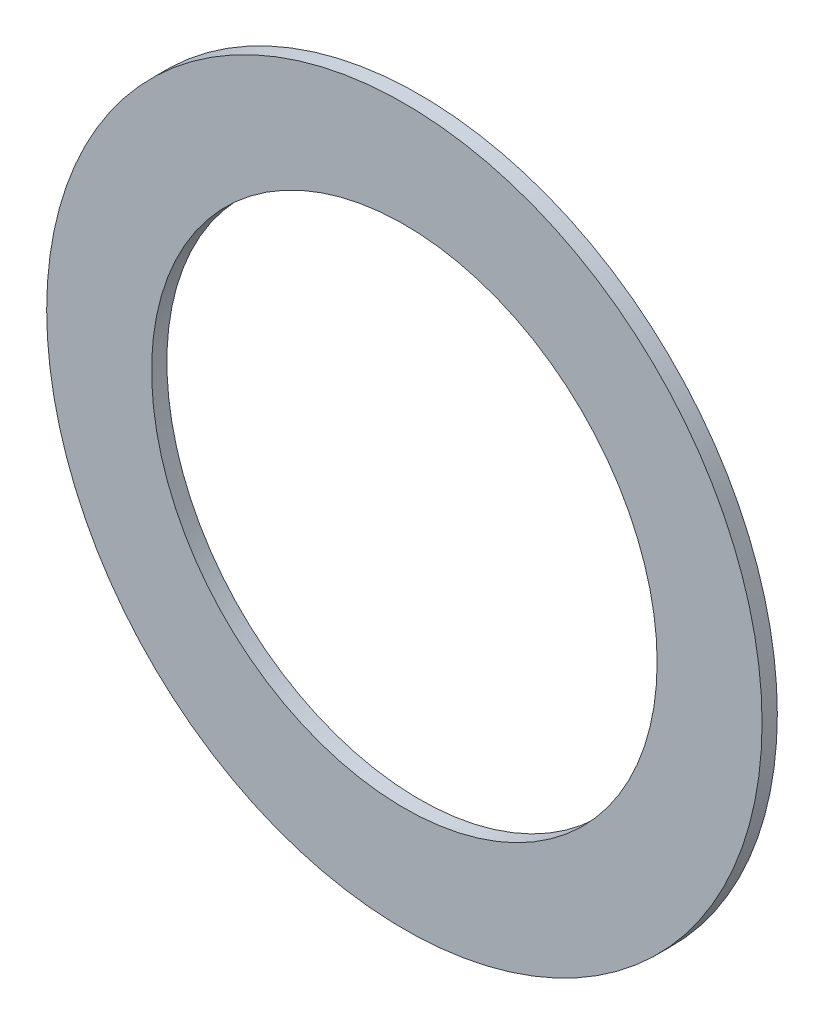
ISO-10303-21;
HEADER;
FILE_DESCRIPTION(('STEP AP214'),'2;1');
FILE_NAME('part.step','',(''),(''),'','','');
FILE_SCHEMA(('AUTOMOTIVE_DESIGN { 1 0 10303 214 1 1 1 1 }'));
ENDSEC;
DATA;
#1=APPLICATION_CONTEXT('core data for automotive mechanical design processes');
#2=APPLICATION_PROTOCOL_DEFINITION('international standard','automotive_design',2000,#1);
#3=PRODUCT_CONTEXT('',#1,'mechanical');
#4=PRODUCT('Part','Part','',(#3));
#5=PRODUCT_RELATED_PRODUCT_CATEGORY('part','',(#4));
#6=PRODUCT_DEFINITION_FORMATION('','',#4);
#7=PRODUCT_DEFINITION_CONTEXT('part definition',#1,'design');
#8=PRODUCT_DEFINITION('design','',#6,#7);
#9=PRODUCT_DEFINITION_SHAPE('','',#8);
#10=(LENGTH_UNIT() NAMED_UNIT(*) SI_UNIT(.MILLI.,.METRE.));
#11=(NAMED_UNIT(*) PLANE_ANGLE_UNIT() SI_UNIT($,.RADIAN.));
#12=(NAMED_UNIT(*) SI_UNIT($,.STERADIAN.) SOLID_ANGLE_UNIT());
#13=UNCERTAINTY_MEASURE_WITH_UNIT(LENGTH_MEASURE(1.E-05),#10,'distance_accuracy_value','');
#14=(GEOMETRIC_REPRESENTATION_CONTEXT(3) GLOBAL_UNCERTAINTY_ASSIGNED_CONTEXT((#13)) GLOBAL_UNIT_ASSIGNED_CONTEXT((#10,
#11,#12)) REPRESENTATION_CONTEXT('',''));
#15=CARTESIAN_POINT('',(0.,0.,0.));
#16=DIRECTION('',(0.,0.,1.));
#17=DIRECTION('',(1.,0.,0.));
#18=AXIS2_PLACEMENT_3D('',#15,#16,#17);
#19=CARTESIAN_POINT('',(0.,0.,0.));
#20=DIRECTION('',(0.,0.,-1.));
#21=DIRECTION('',(-1.,0.,0.));
#22=AXIS2_PLACEMENT_3D('',#19,#20,#21);
#23=PLANE('',#22);
#24=CARTESIAN_POINT('',(0.,0.,0.));
#25=DIRECTION('',(0.,0.,1.));
#26=DIRECTION('',(1.,0.,0.));
#27=AXIS2_PLACEMENT_3D('',#24,#25,#26);
#28=CIRCLE('',#27,6.731);
#29=CARTESIAN_POINT('',(6.731,0.,0.));
#30=VERTEX_POINT('',#29);
#31=EDGE_CURVE('E27',#30,#30,#28,.T.);
#32=ORIENTED_EDGE('',*,*,#31,.T.);
#33=EDGE_LOOP('',(#32));
#34=FACE_BOUND('',#33,.T.);
#35=CARTESIAN_POINT('',(0.,0.,0.));
#36=DIRECTION('',(0.,0.,1.));
#37=DIRECTION('',(1.,0.,0.));
#38=AXIS2_PLACEMENT_3D('',#35,#36,#37);
#39=CIRCLE('',#38,9.525);
#40=CARTESIAN_POINT('',(9.525,0.,0.));
#41=VERTEX_POINT('',#40);
#42=EDGE_CURVE('E18',#41,#41,#39,.T.);
#43=ORIENTED_EDGE('',*,*,#42,.F.);
#44=EDGE_LOOP('',(#43));
#45=FACE_BOUND('',#44,.T.);
#46=ADVANCED_FACE('F15',(#34,#45),#23,.T.);
#47=CARTESIAN_POINT('',(0.,0.,0.));
#48=DIRECTION('',(0.,0.,1.));
#49=DIRECTION('',(1.,0.,0.));
#50=AXIS2_PLACEMENT_3D('',#47,#48,#49);
#51=CYLINDRICAL_SURFACE('',#50,9.525);
#52=ORIENTED_EDGE('',*,*,#42,.T.);
#53=EDGE_LOOP('',(#52));
#54=FACE_BOUND('',#53,.T.);
#55=CARTESIAN_POINT('',(0.,0.,0.4064));
#56=DIRECTION('',(0.,0.,1.));
#57=DIRECTION('',(1.,0.,0.));
#58=AXIS2_PLACEMENT_3D('',#55,#56,#57);
#59=CIRCLE('',#58,9.525);
#60=CARTESIAN_POINT('',(9.525,0.,0.4064));
#61=VERTEX_POINT('',#60);
#62=EDGE_CURVE('E22',#61,#61,#59,.F.);
#63=ORIENTED_EDGE('',*,*,#62,.T.);
#64=EDGE_LOOP('',(#63));
#65=FACE_BOUND('',#64,.T.);
#66=ADVANCED_FACE('F35',(#54,#65),#51,.T.);
#67=CARTESIAN_POINT('',(0.,0.,0.));
#68=DIRECTION('',(0.,0.,1.));
#69=DIRECTION('',(1.,0.,0.));
#70=AXIS2_PLACEMENT_3D('',#67,#68,#69);
#71=CYLINDRICAL_SURFACE('',#70,6.731);
#72=ORIENTED_EDGE('',*,*,#31,.F.);
#73=EDGE_LOOP('',(#72));
#74=FACE_BOUND('',#73,.T.);
#75=CARTESIAN_POINT('',(0.,0.,0.4064));
#76=DIRECTION('',(0.,0.,1.));
#77=DIRECTION('',(1.,0.,0.));
#78=AXIS2_PLACEMENT_3D('',#75,#76,#77);
#79=CIRCLE('',#78,6.731);
#80=CARTESIAN_POINT('',(6.731,0.,0.4064));
#81=VERTEX_POINT('',#80);
#82=EDGE_CURVE('E10',#81,#81,#79,.T.);
#83=ORIENTED_EDGE('',*,*,#82,.T.);
#84=EDGE_LOOP('',(#83));
#85=FACE_BOUND('',#84,.T.);
#86=ADVANCED_FACE('F43',(#74,#85),#71,.F.);
#87=CARTESIAN_POINT('',(0.,0.,0.4064));
#88=DIRECTION('',(0.,0.,-1.));
#89=DIRECTION('',(-1.,0.,0.));
#90=AXIS2_PLACEMENT_3D('',#87,#88,#89);
#91=PLANE('',#90);
#92=ORIENTED_EDGE('',*,*,#82,.F.);
#93=EDGE_LOOP('',(#92));
#94=FACE_BOUND('',#93,.T.);
#95=ORIENTED_EDGE('',*,*,#62,.F.);
#96=EDGE_LOOP('',(#95));
#97=FACE_BOUND('',#96,.T.);
#98=ADVANCED_FACE('F44',(#94,#97),#91,.F.);
#99=CLOSED_SHELL('',(#46,#66,#86,#98));
#100=MANIFOLD_SOLID_BREP('B1',#99);
#101=ADVANCED_BREP_SHAPE_REPRESENTATION('',(#18,#100),#14);
#102=SHAPE_DEFINITION_REPRESENTATION(#9,#101);
ENDSEC;
END-ISO-10303-21;
